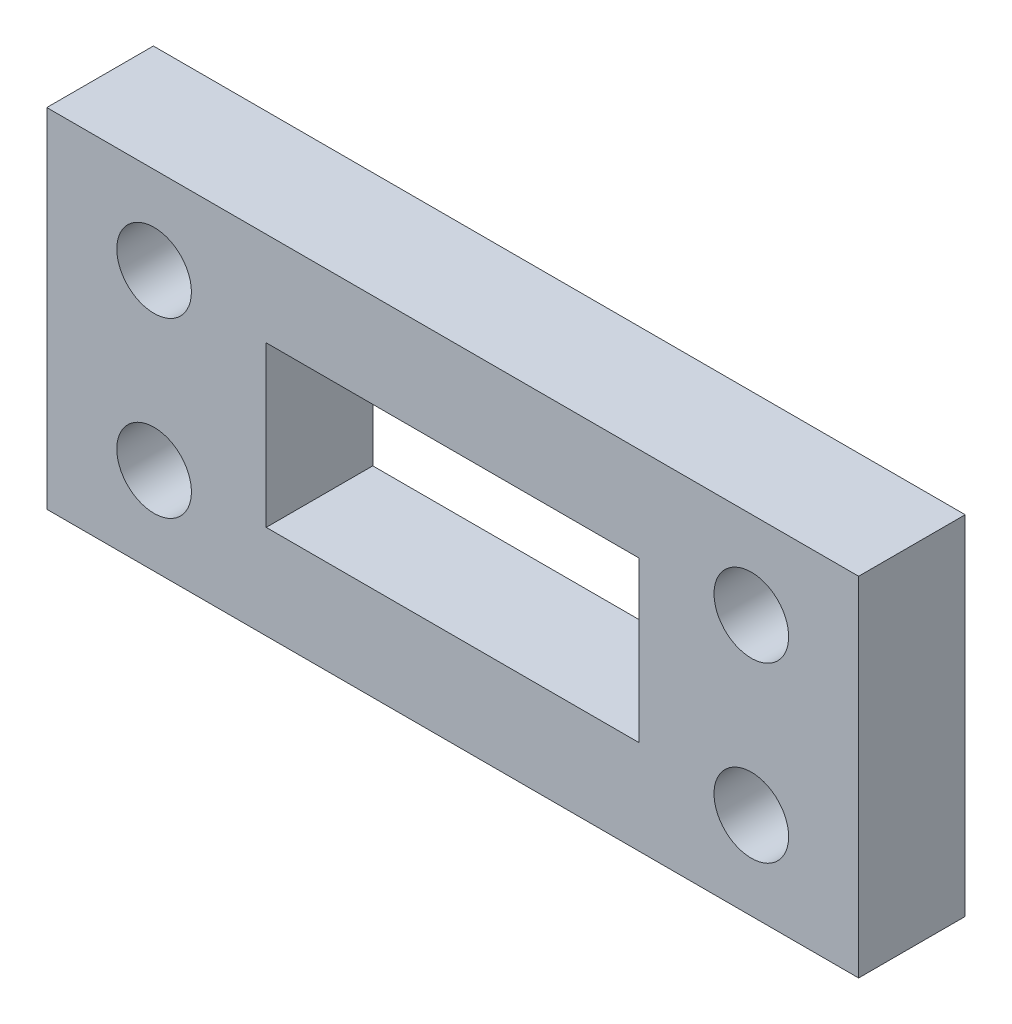
ISO-10303-21;
HEADER;
FILE_DESCRIPTION(('STEP AP214'),'2;1');
FILE_NAME('part.step','',(''),(''),'','','');
FILE_SCHEMA(('AUTOMOTIVE_DESIGN { 1 0 10303 214 1 1 1 1 }'));
ENDSEC;
DATA;
#1=APPLICATION_CONTEXT('core data for automotive mechanical design processes');
#2=APPLICATION_PROTOCOL_DEFINITION('international standard','automotive_design',2000,#1);
#3=PRODUCT_CONTEXT('',#1,'mechanical');
#4=PRODUCT('Part','Part','',(#3));
#5=PRODUCT_RELATED_PRODUCT_CATEGORY('part','',(#4));
#6=PRODUCT_DEFINITION_FORMATION('','',#4);
#7=PRODUCT_DEFINITION_CONTEXT('part definition',#1,'design');
#8=PRODUCT_DEFINITION('design','',#6,#7);
#9=PRODUCT_DEFINITION_SHAPE('','',#8);
#10=(LENGTH_UNIT() NAMED_UNIT(*) SI_UNIT(.MILLI.,.METRE.));
#11=(NAMED_UNIT(*) PLANE_ANGLE_UNIT() SI_UNIT($,.RADIAN.));
#12=(NAMED_UNIT(*) SI_UNIT($,.STERADIAN.) SOLID_ANGLE_UNIT());
#13=UNCERTAINTY_MEASURE_WITH_UNIT(LENGTH_MEASURE(1.E-05),#10,'distance_accuracy_value','');
#14=(GEOMETRIC_REPRESENTATION_CONTEXT(3) GLOBAL_UNCERTAINTY_ASSIGNED_CONTEXT((#13)) GLOBAL_UNIT_ASSIGNED_CONTEXT((#10,
#11,#12)) REPRESENTATION_CONTEXT('',''));
#15=CARTESIAN_POINT('',(0.,0.,0.));
#16=DIRECTION('',(0.,0.,1.));
#17=DIRECTION('',(1.,0.,0.));
#18=AXIS2_PLACEMENT_3D('',#15,#16,#17);
#19=CARTESIAN_POINT('',(0.,0.,20.));
#20=DIRECTION('',(0.,0.,-1.));
#21=DIRECTION('',(-1.,0.,0.));
#22=AXIS2_PLACEMENT_3D('',#19,#20,#21);
#23=PLANE('',#22);
#24=CARTESIAN_POINT('',(-56.0389694293356,-16.2505376344086,20.));
#25=DIRECTION('',(0.,0.,1.));
#26=DIRECTION('',(-1.,0.,0.));
#27=AXIS2_PLACEMENT_3D('',#24,#25,#26);
#28=CIRCLE('',#27,7.);
#29=CARTESIAN_POINT('',(-63.0389694293356,-16.2505376344086,20.));
#30=VERTEX_POINT('',#29);
#31=EDGE_CURVE('E138',#30,#30,#28,.T.);
#32=ORIENTED_EDGE('',*,*,#31,.F.);
#33=EDGE_LOOP('',(#32));
#34=FACE_BOUND('',#33,.T.);
#35=CARTESIAN_POINT('',(56.0389694293357,-16.2505376344086,20.));
#36=DIRECTION('',(0.,0.,1.));
#37=DIRECTION('',(1.,0.,0.));
#38=AXIS2_PLACEMENT_3D('',#35,#36,#37);
#39=CIRCLE('',#38,7.00000000000001);
#40=CARTESIAN_POINT('',(63.0389694293357,-16.2505376344086,20.));
#41=VERTEX_POINT('',#40);
#42=EDGE_CURVE('E144',#41,#41,#39,.T.);
#43=ORIENTED_EDGE('',*,*,#42,.F.);
#44=EDGE_LOOP('',(#43));
#45=FACE_BOUND('',#44,.T.);
#46=CARTESIAN_POINT('',(56.0389694293357,16.2505376344086,20.));
#47=DIRECTION('',(0.,0.,1.));
#48=DIRECTION('',(-1.,0.,0.));
#49=AXIS2_PLACEMENT_3D('',#46,#47,#48);
#50=CIRCLE('',#49,7.00000000000001);
#51=CARTESIAN_POINT('',(49.0389694293357,16.2505376344086,20.));
#52=VERTEX_POINT('',#51);
#53=EDGE_CURVE('E150',#52,#52,#50,.T.);
#54=ORIENTED_EDGE('',*,*,#53,.F.);
#55=EDGE_LOOP('',(#54));
#56=FACE_BOUND('',#55,.T.);
#57=CARTESIAN_POINT('',(-56.0389694293356,16.2505376344086,20.));
#58=DIRECTION('',(0.,0.,1.));
#59=DIRECTION('',(1.,0.,0.));
#60=AXIS2_PLACEMENT_3D('',#57,#58,#59);
#61=CIRCLE('',#60,7.);
#62=CARTESIAN_POINT('',(-49.0389694293356,16.2505376344086,20.));
#63=VERTEX_POINT('',#62);
#64=EDGE_CURVE('E156',#63,#63,#61,.T.);
#65=ORIENTED_EDGE('',*,*,#64,.F.);
#66=EDGE_LOOP('',(#65));
#67=FACE_BOUND('',#66,.T.);
#68=DIRECTION('',(0.,-1.,0.));
#69=VECTOR('',#68,1.);
#70=CARTESIAN_POINT('',(-76.1751361114357,32.646486904901,20.));
#71=LINE('',#70,#69);
#72=CARTESIAN_POINT('',(-76.1751361114357,32.646486904901,20.));
#73=VERTEX_POINT('',#72);
#74=CARTESIAN_POINT('',(-76.1751361114356,-32.646486904901,20.));
#75=VERTEX_POINT('',#74);
#76=EDGE_CURVE('E162',#73,#75,#71,.T.);
#77=ORIENTED_EDGE('',*,*,#76,.T.);
#78=DIRECTION('',(1.,0.,0.));
#79=VECTOR('',#78,1.);
#80=CARTESIAN_POINT('',(76.1751361114357,-32.646486904901,20.));
#81=LINE('',#80,#79);
#82=CARTESIAN_POINT('',(76.1751361114357,-32.646486904901,20.));
#83=VERTEX_POINT('',#82);
#84=EDGE_CURVE('E165',#75,#83,#81,.T.);
#85=ORIENTED_EDGE('',*,*,#84,.T.);
#86=DIRECTION('',(0.,1.,0.));
#87=VECTOR('',#86,1.);
#88=CARTESIAN_POINT('',(76.1751361114357,32.646486904901,20.));
#89=LINE('',#88,#87);
#90=CARTESIAN_POINT('',(76.1751361114357,32.646486904901,20.));
#91=VERTEX_POINT('',#90);
#92=EDGE_CURVE('E168',#83,#91,#89,.T.);
#93=ORIENTED_EDGE('',*,*,#92,.T.);
#94=DIRECTION('',(-1.,0.,0.));
#95=VECTOR('',#94,1.);
#96=CARTESIAN_POINT('',(76.1751361114357,32.646486904901,20.));
#97=LINE('',#96,#95);
#98=EDGE_CURVE('E170',#91,#73,#97,.T.);
#99=ORIENTED_EDGE('',*,*,#98,.T.);
#100=EDGE_LOOP('',(#77,#85,#93,#99));
#101=FACE_BOUND('',#100,.T.);
#102=DIRECTION('',(0.,1.,0.));
#103=VECTOR('',#102,1.);
#104=CARTESIAN_POINT('',(35.,15.,20.));
#105=LINE('',#104,#103);
#106=CARTESIAN_POINT('',(35.,-15.,20.));
#107=VERTEX_POINT('',#106);
#108=CARTESIAN_POINT('',(35.,15.,20.));
#109=VERTEX_POINT('',#108);
#110=EDGE_CURVE('E102',#107,#109,#105,.T.);
#111=ORIENTED_EDGE('',*,*,#110,.F.);
#112=DIRECTION('',(1.,0.,0.));
#113=VECTOR('',#112,1.);
#114=CARTESIAN_POINT('',(-35.,-15.,20.));
#115=LINE('',#114,#113);
#116=CARTESIAN_POINT('',(-35.,-15.,20.));
#117=VERTEX_POINT('',#116);
#118=EDGE_CURVE('E124',#117,#107,#115,.T.);
#119=ORIENTED_EDGE('',*,*,#118,.F.);
#120=DIRECTION('',(0.,-1.,0.));
#121=VECTOR('',#120,1.);
#122=CARTESIAN_POINT('',(-35.,15.,20.));
#123=LINE('',#122,#121);
#124=CARTESIAN_POINT('',(-35.,15.,20.));
#125=VERTEX_POINT('',#124);
#126=EDGE_CURVE('E122',#125,#117,#123,.T.);
#127=ORIENTED_EDGE('',*,*,#126,.F.);
#128=DIRECTION('',(-1.,0.,0.));
#129=VECTOR('',#128,1.);
#130=CARTESIAN_POINT('',(-35.,15.,20.));
#131=LINE('',#130,#129);
#132=EDGE_CURVE('E110',#109,#125,#131,.T.);
#133=ORIENTED_EDGE('',*,*,#132,.F.);
#134=EDGE_LOOP('',(#111,#119,#127,#133));
#135=FACE_BOUND('',#134,.T.);
#136=ADVANCED_FACE('F37',(#34,#45,#56,#67,#101,#135),#23,.F.);
#137=CARTESIAN_POINT('',(0.,0.,0.));
#138=DIRECTION('',(0.,0.,-1.));
#139=DIRECTION('',(-1.,0.,0.));
#140=AXIS2_PLACEMENT_3D('',#137,#138,#139);
#141=PLANE('',#140);
#142=CARTESIAN_POINT('',(56.0389694293357,-16.2505376344086,0.));
#143=DIRECTION('',(0.,0.,1.));
#144=DIRECTION('',(1.,0.,0.));
#145=AXIS2_PLACEMENT_3D('',#142,#143,#144);
#146=CIRCLE('',#145,7.00000000000001);
#147=CARTESIAN_POINT('',(63.0389694293357,-16.2505376344086,0.));
#148=VERTEX_POINT('',#147);
#149=EDGE_CURVE('E141',#148,#148,#146,.T.);
#150=ORIENTED_EDGE('',*,*,#149,.T.);
#151=EDGE_LOOP('',(#150));
#152=FACE_BOUND('',#151,.T.);
#153=CARTESIAN_POINT('',(-56.0389694293356,16.2505376344086,0.));
#154=DIRECTION('',(0.,0.,1.));
#155=DIRECTION('',(1.,0.,0.));
#156=AXIS2_PLACEMENT_3D('',#153,#154,#155);
#157=CIRCLE('',#156,7.);
#158=CARTESIAN_POINT('',(-49.0389694293356,16.2505376344086,0.));
#159=VERTEX_POINT('',#158);
#160=EDGE_CURVE('E153',#159,#159,#157,.T.);
#161=ORIENTED_EDGE('',*,*,#160,.T.);
#162=EDGE_LOOP('',(#161));
#163=FACE_BOUND('',#162,.T.);
#164=DIRECTION('',(0.,-1.,0.));
#165=VECTOR('',#164,1.);
#166=CARTESIAN_POINT('',(-76.1751361114357,32.646486904901,0.));
#167=LINE('',#166,#165);
#168=CARTESIAN_POINT('',(-76.1751361114357,32.646486904901,0.));
#169=VERTEX_POINT('',#168);
#170=CARTESIAN_POINT('',(-76.1751361114356,-32.646486904901,0.));
#171=VERTEX_POINT('',#170);
#172=EDGE_CURVE('E159',#169,#171,#167,.T.);
#173=ORIENTED_EDGE('',*,*,#172,.F.);
#174=DIRECTION('',(-1.,0.,0.));
#175=VECTOR('',#174,1.);
#176=CARTESIAN_POINT('',(76.1751361114357,32.646486904901,0.));
#177=LINE('',#176,#175);
#178=CARTESIAN_POINT('',(76.1751361114357,32.646486904901,0.));
#179=VERTEX_POINT('',#178);
#180=EDGE_CURVE('E166',#179,#169,#177,.T.);
#181=ORIENTED_EDGE('',*,*,#180,.F.);
#182=DIRECTION('',(0.,1.,0.));
#183=VECTOR('',#182,1.);
#184=CARTESIAN_POINT('',(76.1751361114357,32.646486904901,0.));
#185=LINE('',#184,#183);
#186=CARTESIAN_POINT('',(76.1751361114357,-32.646486904901,0.));
#187=VERTEX_POINT('',#186);
#188=EDGE_CURVE('E177',#187,#179,#185,.T.);
#189=ORIENTED_EDGE('',*,*,#188,.F.);
#190=DIRECTION('',(1.,0.,0.));
#191=VECTOR('',#190,1.);
#192=CARTESIAN_POINT('',(76.1751361114357,-32.646486904901,0.));
#193=LINE('',#192,#191);
#194=EDGE_CURVE('E175',#171,#187,#193,.T.);
#195=ORIENTED_EDGE('',*,*,#194,.F.);
#196=EDGE_LOOP('',(#173,#181,#189,#195));
#197=FACE_BOUND('',#196,.T.);
#198=CARTESIAN_POINT('',(56.0389694293357,16.2505376344086,0.));
#199=DIRECTION('',(0.,0.,1.));
#200=DIRECTION('',(-1.,0.,0.));
#201=AXIS2_PLACEMENT_3D('',#198,#199,#200);
#202=CIRCLE('',#201,7.00000000000001);
#203=CARTESIAN_POINT('',(49.0389694293357,16.2505376344086,0.));
#204=VERTEX_POINT('',#203);
#205=EDGE_CURVE('E147',#204,#204,#202,.T.);
#206=ORIENTED_EDGE('',*,*,#205,.T.);
#207=EDGE_LOOP('',(#206));
#208=FACE_BOUND('',#207,.T.);
#209=CARTESIAN_POINT('',(-56.0389694293356,-16.2505376344086,0.));
#210=DIRECTION('',(0.,0.,1.));
#211=DIRECTION('',(-1.,0.,0.));
#212=AXIS2_PLACEMENT_3D('',#209,#210,#211);
#213=CIRCLE('',#212,7.);
#214=CARTESIAN_POINT('',(-63.0389694293356,-16.2505376344086,0.));
#215=VERTEX_POINT('',#214);
#216=EDGE_CURVE('E118',#215,#215,#213,.T.);
#217=ORIENTED_EDGE('',*,*,#216,.T.);
#218=EDGE_LOOP('',(#217));
#219=FACE_BOUND('',#218,.T.);
#220=DIRECTION('',(1.,0.,0.));
#221=VECTOR('',#220,1.);
#222=CARTESIAN_POINT('',(-35.,-15.,0.));
#223=LINE('',#222,#221);
#224=CARTESIAN_POINT('',(-35.,-15.,0.));
#225=VERTEX_POINT('',#224);
#226=CARTESIAN_POINT('',(35.,-15.,0.));
#227=VERTEX_POINT('',#226);
#228=EDGE_CURVE('E111',#225,#227,#223,.T.);
#229=ORIENTED_EDGE('',*,*,#228,.T.);
#230=DIRECTION('',(0.,1.,0.));
#231=VECTOR('',#230,1.);
#232=CARTESIAN_POINT('',(35.,15.,0.));
#233=LINE('',#232,#231);
#234=CARTESIAN_POINT('',(35.,15.,0.));
#235=VERTEX_POINT('',#234);
#236=EDGE_CURVE('E60',#227,#235,#233,.T.);
#237=ORIENTED_EDGE('',*,*,#236,.T.);
#238=DIRECTION('',(-1.,0.,0.));
#239=VECTOR('',#238,1.);
#240=CARTESIAN_POINT('',(-35.,15.,0.));
#241=LINE('',#240,#239);
#242=CARTESIAN_POINT('',(-35.,15.,0.));
#243=VERTEX_POINT('',#242);
#244=EDGE_CURVE('E117',#235,#243,#241,.T.);
#245=ORIENTED_EDGE('',*,*,#244,.T.);
#246=DIRECTION('',(0.,-1.,0.));
#247=VECTOR('',#246,1.);
#248=CARTESIAN_POINT('',(-35.,15.,0.));
#249=LINE('',#248,#247);
#250=EDGE_CURVE('E130',#243,#225,#249,.T.);
#251=ORIENTED_EDGE('',*,*,#250,.T.);
#252=EDGE_LOOP('',(#229,#237,#245,#251));
#253=FACE_BOUND('',#252,.T.);
#254=ADVANCED_FACE('F195',(#152,#163,#197,#208,#219,#253),#141,.T.);
#255=CARTESIAN_POINT('',(-76.1751361114357,32.646486904901,20.));
#256=DIRECTION('',(1.,0.,0.));
#257=DIRECTION('',(0.,1.,0.));
#258=AXIS2_PLACEMENT_3D('',#255,#256,#257);
#259=PLANE('',#258);
#260=ORIENTED_EDGE('',*,*,#172,.T.);
#261=DIRECTION('',(0.,0.,-1.));
#262=VECTOR('',#261,1.);
#263=CARTESIAN_POINT('',(-76.1751361114356,-32.646486904901,20.));
#264=LINE('',#263,#262);
#265=EDGE_CURVE('E11',#75,#171,#264,.T.);
#266=ORIENTED_EDGE('',*,*,#265,.F.);
#267=ORIENTED_EDGE('',*,*,#76,.F.);
#268=DIRECTION('',(0.,0.,-1.));
#269=VECTOR('',#268,1.);
#270=CARTESIAN_POINT('',(-76.1751361114357,32.646486904901,20.));
#271=LINE('',#270,#269);
#272=EDGE_CURVE('E172',#73,#169,#271,.T.);
#273=ORIENTED_EDGE('',*,*,#272,.T.);
#274=EDGE_LOOP('',(#260,#266,#267,#273));
#275=FACE_BOUND('',#274,.T.);
#276=ADVANCED_FACE('F39',(#275),#259,.F.);
#277=CARTESIAN_POINT('',(76.1751361114357,-32.646486904901,20.));
#278=DIRECTION('',(0.,1.,0.));
#279=DIRECTION('',(-1.,0.,0.));
#280=AXIS2_PLACEMENT_3D('',#277,#278,#279);
#281=PLANE('',#280);
#282=ORIENTED_EDGE('',*,*,#194,.T.);
#283=DIRECTION('',(0.,0.,-1.));
#284=VECTOR('',#283,1.);
#285=CARTESIAN_POINT('',(76.1751361114357,-32.646486904901,20.));
#286=LINE('',#285,#284);
#287=EDGE_CURVE('E45',#83,#187,#286,.T.);
#288=ORIENTED_EDGE('',*,*,#287,.F.);
#289=ORIENTED_EDGE('',*,*,#84,.F.);
#290=ORIENTED_EDGE('',*,*,#265,.T.);
#291=EDGE_LOOP('',(#282,#288,#289,#290));
#292=FACE_BOUND('',#291,.T.);
#293=ADVANCED_FACE('F205',(#292),#281,.F.);
#294=CARTESIAN_POINT('',(76.1751361114357,32.646486904901,20.));
#295=DIRECTION('',(-1.,0.,0.));
#296=DIRECTION('',(0.,0.,1.));
#297=AXIS2_PLACEMENT_3D('',#294,#295,#296);
#298=PLANE('',#297);
#299=ORIENTED_EDGE('',*,*,#188,.T.);
#300=DIRECTION('',(0.,0.,-1.));
#301=VECTOR('',#300,1.);
#302=CARTESIAN_POINT('',(76.1751361114357,32.646486904901,20.));
#303=LINE('',#302,#301);
#304=EDGE_CURVE('E182',#91,#179,#303,.T.);
#305=ORIENTED_EDGE('',*,*,#304,.F.);
#306=ORIENTED_EDGE('',*,*,#92,.F.);
#307=ORIENTED_EDGE('',*,*,#287,.T.);
#308=EDGE_LOOP('',(#299,#305,#306,#307));
#309=FACE_BOUND('',#308,.T.);
#310=ADVANCED_FACE('F189',(#309),#298,.F.);
#311=CARTESIAN_POINT('',(76.1751361114357,32.646486904901,20.));
#312=DIRECTION('',(0.,-1.,0.));
#313=DIRECTION('',(1.,0.,0.));
#314=AXIS2_PLACEMENT_3D('',#311,#312,#313);
#315=PLANE('',#314);
#316=ORIENTED_EDGE('',*,*,#180,.T.);
#317=ORIENTED_EDGE('',*,*,#272,.F.);
#318=ORIENTED_EDGE('',*,*,#98,.F.);
#319=ORIENTED_EDGE('',*,*,#304,.T.);
#320=EDGE_LOOP('',(#316,#317,#318,#319));
#321=FACE_BOUND('',#320,.T.);
#322=ADVANCED_FACE('F199',(#321),#315,.F.);
#323=CARTESIAN_POINT('',(-56.0389694293356,16.2505376344086,20.));
#324=DIRECTION('',(0.,0.,-1.));
#325=DIRECTION('',(-1.,0.,0.));
#326=AXIS2_PLACEMENT_3D('',#323,#324,#325);
#327=CYLINDRICAL_SURFACE('',#326,7.);
#328=ORIENTED_EDGE('',*,*,#64,.T.);
#329=EDGE_LOOP('',(#328));
#330=FACE_BOUND('',#329,.T.);
#331=ORIENTED_EDGE('',*,*,#160,.F.);
#332=EDGE_LOOP('',(#331));
#333=FACE_BOUND('',#332,.T.);
#334=ADVANCED_FACE('F223',(#330,#333),#327,.F.);
#335=CARTESIAN_POINT('',(56.0389694293357,16.2505376344086,20.));
#336=DIRECTION('',(0.,0.,-1.));
#337=DIRECTION('',(-1.,0.,0.));
#338=AXIS2_PLACEMENT_3D('',#335,#336,#337);
#339=CYLINDRICAL_SURFACE('',#338,7.00000000000001);
#340=ORIENTED_EDGE('',*,*,#53,.T.);
#341=EDGE_LOOP('',(#340));
#342=FACE_BOUND('',#341,.T.);
#343=ORIENTED_EDGE('',*,*,#205,.F.);
#344=EDGE_LOOP('',(#343));
#345=FACE_BOUND('',#344,.T.);
#346=ADVANCED_FACE('F230',(#342,#345),#339,.F.);
#347=CARTESIAN_POINT('',(56.0389694293357,-16.2505376344086,20.));
#348=DIRECTION('',(0.,0.,-1.));
#349=DIRECTION('',(-1.,0.,0.));
#350=AXIS2_PLACEMENT_3D('',#347,#348,#349);
#351=CYLINDRICAL_SURFACE('',#350,7.00000000000001);
#352=ORIENTED_EDGE('',*,*,#42,.T.);
#353=EDGE_LOOP('',(#352));
#354=FACE_BOUND('',#353,.T.);
#355=ORIENTED_EDGE('',*,*,#149,.F.);
#356=EDGE_LOOP('',(#355));
#357=FACE_BOUND('',#356,.T.);
#358=ADVANCED_FACE('F235',(#354,#357),#351,.F.);
#359=CARTESIAN_POINT('',(-56.0389694293356,-16.2505376344086,20.));
#360=DIRECTION('',(0.,0.,-1.));
#361=DIRECTION('',(-1.,0.,0.));
#362=AXIS2_PLACEMENT_3D('',#359,#360,#361);
#363=CYLINDRICAL_SURFACE('',#362,7.);
#364=ORIENTED_EDGE('',*,*,#31,.T.);
#365=EDGE_LOOP('',(#364));
#366=FACE_BOUND('',#365,.T.);
#367=ORIENTED_EDGE('',*,*,#216,.F.);
#368=EDGE_LOOP('',(#367));
#369=FACE_BOUND('',#368,.T.);
#370=ADVANCED_FACE('F245',(#366,#369),#363,.F.);
#371=CARTESIAN_POINT('',(35.,15.,20.));
#372=DIRECTION('',(-1.,0.,0.));
#373=DIRECTION('',(0.,0.,1.));
#374=AXIS2_PLACEMENT_3D('',#371,#372,#373);
#375=PLANE('',#374);
#376=ORIENTED_EDGE('',*,*,#236,.F.);
#377=DIRECTION('',(0.,0.,-1.));
#378=VECTOR('',#377,1.);
#379=CARTESIAN_POINT('',(35.,-15.,20.));
#380=LINE('',#379,#378);
#381=EDGE_CURVE('E106',#107,#227,#380,.T.);
#382=ORIENTED_EDGE('',*,*,#381,.F.);
#383=ORIENTED_EDGE('',*,*,#110,.T.);
#384=DIRECTION('',(0.,0.,-1.));
#385=VECTOR('',#384,1.);
#386=CARTESIAN_POINT('',(35.,15.,20.));
#387=LINE('',#386,#385);
#388=EDGE_CURVE('E105',#109,#235,#387,.T.);
#389=ORIENTED_EDGE('',*,*,#388,.T.);
#390=EDGE_LOOP('',(#376,#382,#383,#389));
#391=FACE_BOUND('',#390,.T.);
#392=ADVANCED_FACE('F104',(#391),#375,.T.);
#393=CARTESIAN_POINT('',(-35.,15.,20.));
#394=DIRECTION('',(0.,-1.,0.));
#395=DIRECTION('',(1.,0.,0.));
#396=AXIS2_PLACEMENT_3D('',#393,#394,#395);
#397=PLANE('',#396);
#398=ORIENTED_EDGE('',*,*,#244,.F.);
#399=ORIENTED_EDGE('',*,*,#388,.F.);
#400=ORIENTED_EDGE('',*,*,#132,.T.);
#401=DIRECTION('',(0.,0.,-1.));
#402=VECTOR('',#401,1.);
#403=CARTESIAN_POINT('',(-35.,15.,20.));
#404=LINE('',#403,#402);
#405=EDGE_CURVE('E119',#125,#243,#404,.T.);
#406=ORIENTED_EDGE('',*,*,#405,.T.);
#407=EDGE_LOOP('',(#398,#399,#400,#406));
#408=FACE_BOUND('',#407,.T.);
#409=ADVANCED_FACE('F114',(#408),#397,.T.);
#410=CARTESIAN_POINT('',(-35.,15.,20.));
#411=DIRECTION('',(1.,0.,0.));
#412=DIRECTION('',(0.,1.,0.));
#413=AXIS2_PLACEMENT_3D('',#410,#411,#412);
#414=PLANE('',#413);
#415=ORIENTED_EDGE('',*,*,#250,.F.);
#416=ORIENTED_EDGE('',*,*,#405,.F.);
#417=ORIENTED_EDGE('',*,*,#126,.T.);
#418=DIRECTION('',(0.,0.,-1.));
#419=VECTOR('',#418,1.);
#420=CARTESIAN_POINT('',(-35.,-15.,20.));
#421=LINE('',#420,#419);
#422=EDGE_CURVE('E52',#117,#225,#421,.T.);
#423=ORIENTED_EDGE('',*,*,#422,.T.);
#424=EDGE_LOOP('',(#415,#416,#417,#423));
#425=FACE_BOUND('',#424,.T.);
#426=ADVANCED_FACE('F257',(#425),#414,.T.);
#427=CARTESIAN_POINT('',(-35.,-15.,20.));
#428=DIRECTION('',(0.,1.,0.));
#429=DIRECTION('',(0.,0.,1.));
#430=AXIS2_PLACEMENT_3D('',#427,#428,#429);
#431=PLANE('',#430);
#432=ORIENTED_EDGE('',*,*,#228,.F.);
#433=ORIENTED_EDGE('',*,*,#422,.F.);
#434=ORIENTED_EDGE('',*,*,#118,.T.);
#435=ORIENTED_EDGE('',*,*,#381,.T.);
#436=EDGE_LOOP('',(#432,#433,#434,#435));
#437=FACE_BOUND('',#436,.T.);
#438=ADVANCED_FACE('F260',(#437),#431,.T.);
#439=CLOSED_SHELL('',(#136,#254,#276,#293,#310,#322,#334,#346,#358,#370,#392,#409,#426,#438));
#440=MANIFOLD_SOLID_BREP('B2',#439);
#441=ADVANCED_BREP_SHAPE_REPRESENTATION('',(#18,#440),#14);
#442=SHAPE_DEFINITION_REPRESENTATION(#9,#441);
ENDSEC;
END-ISO-10303-21;
